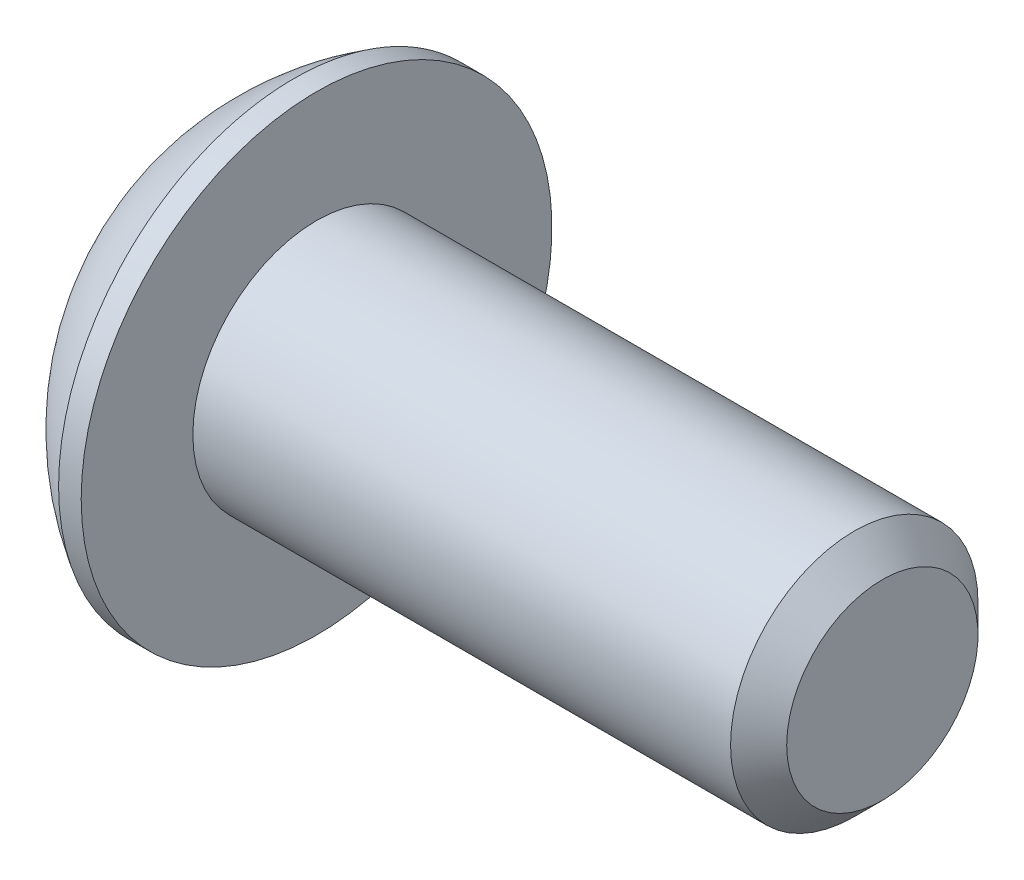
ISO-10303-21;
HEADER;
FILE_DESCRIPTION(('STEP AP214'),'2;1');
FILE_NAME('part.step','',(''),(''),'','','');
FILE_SCHEMA(('AUTOMOTIVE_DESIGN { 1 0 10303 214 1 1 1 1 }'));
ENDSEC;
DATA;
#1=APPLICATION_CONTEXT('core data for automotive mechanical design processes');
#2=APPLICATION_PROTOCOL_DEFINITION('international standard','automotive_design',2000,#1);
#3=PRODUCT_CONTEXT('',#1,'mechanical');
#4=PRODUCT('Part','Part','',(#3));
#5=PRODUCT_RELATED_PRODUCT_CATEGORY('part','',(#4));
#6=PRODUCT_DEFINITION_FORMATION('','',#4);
#7=PRODUCT_DEFINITION_CONTEXT('part definition',#1,'design');
#8=PRODUCT_DEFINITION('design','',#6,#7);
#9=PRODUCT_DEFINITION_SHAPE('','',#8);
#10=(LENGTH_UNIT() NAMED_UNIT(*) SI_UNIT(.MILLI.,.METRE.));
#11=(NAMED_UNIT(*) PLANE_ANGLE_UNIT() SI_UNIT($,.RADIAN.));
#12=(NAMED_UNIT(*) SI_UNIT($,.STERADIAN.) SOLID_ANGLE_UNIT());
#13=UNCERTAINTY_MEASURE_WITH_UNIT(LENGTH_MEASURE(1.E-05),#10,'distance_accuracy_value','');
#14=(GEOMETRIC_REPRESENTATION_CONTEXT(3) GLOBAL_UNCERTAINTY_ASSIGNED_CONTEXT((#13)) GLOBAL_UNIT_ASSIGNED_CONTEXT((#10,
#11,#12)) REPRESENTATION_CONTEXT('',''));
#15=CARTESIAN_POINT('',(0.,0.,0.));
#16=DIRECTION('',(0.,0.,1.));
#17=DIRECTION('',(1.,0.,0.));
#18=AXIS2_PLACEMENT_3D('',#15,#16,#17);
#19=CARTESIAN_POINT('',(1.32080000000034,0.,0.));
#20=DIRECTION('',(-1.,0.,0.));
#21=DIRECTION('',(0.,0.,1.));
#22=AXIS2_PLACEMENT_3D('',#19,#20,#21);
#23=CONICAL_SURFACE('',#22,1.1937999999998,1.04719755119608);
#24=CARTESIAN_POINT('',(2.01004075135902,0.,4.44089209850063E-13));
#25=VERTEX_POINT('',#24);
#26=VERTEX_LOOP('',#25);
#27=FACE_BOUND('',#26,.T.);
#28=CARTESIAN_POINT('',(1.32080000000009,0.,0.));
#29=DIRECTION('',(-1.,0.,0.));
#30=DIRECTION('',(0.,0.,1.));
#31=AXIS2_PLACEMENT_3D('',#28,#29,#30);
#32=CIRCLE('',#31,1.19380000000024);
#33=CARTESIAN_POINT('',(1.32080000000004,-1.03386112703797,0.59690000000006));
#34=VERTEX_POINT('',#33);
#35=CARTESIAN_POINT('',(1.32080000000004,0.,1.19380000000012));
#36=VERTEX_POINT('',#35);
#37=EDGE_CURVE('E20',#34,#36,#32,.T.);
#38=ORIENTED_EDGE('',*,*,#37,.T.);
#39=CARTESIAN_POINT('',(1.32080000000009,0.,0.));
#40=DIRECTION('',(-1.,0.,0.));
#41=DIRECTION('',(0.,0.,1.));
#42=AXIS2_PLACEMENT_3D('',#39,#40,#41);
#43=CIRCLE('',#42,1.19380000000024);
#44=CARTESIAN_POINT('',(1.32080000000004,1.03386112703797,0.596900000000061));
#45=VERTEX_POINT('',#44);
#46=EDGE_CURVE('E148',#36,#45,#43,.T.);
#47=ORIENTED_EDGE('',*,*,#46,.T.);
#48=CARTESIAN_POINT('',(1.32080000000009,0.,0.));
#49=DIRECTION('',(-1.,0.,0.));
#50=DIRECTION('',(0.,0.,1.));
#51=AXIS2_PLACEMENT_3D('',#48,#49,#50);
#52=CIRCLE('',#51,1.19380000000024);
#53=CARTESIAN_POINT('',(1.32080000000004,1.03386112703797,-0.596900000000061));
#54=VERTEX_POINT('',#53);
#55=EDGE_CURVE('E318',#45,#54,#52,.T.);
#56=ORIENTED_EDGE('',*,*,#55,.T.);
#57=CARTESIAN_POINT('',(1.32080000000009,0.,0.));
#58=DIRECTION('',(-1.,0.,0.));
#59=DIRECTION('',(0.,0.,1.));
#60=AXIS2_PLACEMENT_3D('',#57,#58,#59);
#61=CIRCLE('',#60,1.19380000000024);
#62=CARTESIAN_POINT('',(1.32080000000004,1.49457637585666E-12,-1.19380000000012));
#63=VERTEX_POINT('',#62);
#64=EDGE_CURVE('E319',#54,#63,#61,.T.);
#65=ORIENTED_EDGE('',*,*,#64,.T.);
#66=CARTESIAN_POINT('',(1.32080000000009,0.,0.));
#67=DIRECTION('',(-1.,0.,0.));
#68=DIRECTION('',(0.,0.,1.));
#69=AXIS2_PLACEMENT_3D('',#66,#67,#68);
#70=CIRCLE('',#69,1.19380000000024);
#71=CARTESIAN_POINT('',(1.32080000000004,-1.03386112703797,-0.59690000000006));
#72=VERTEX_POINT('',#71);
#73=EDGE_CURVE('E93',#63,#72,#70,.T.);
#74=ORIENTED_EDGE('',*,*,#73,.T.);
#75=CARTESIAN_POINT('',(1.32080000000009,0.,0.));
#76=DIRECTION('',(-1.,0.,0.));
#77=DIRECTION('',(0.,0.,1.));
#78=AXIS2_PLACEMENT_3D('',#75,#76,#77);
#79=CIRCLE('',#78,1.19380000000024);
#80=EDGE_CURVE('E89',#72,#34,#79,.T.);
#81=ORIENTED_EDGE('',*,*,#80,.T.);
#82=EDGE_LOOP('',(#38,#47,#56,#65,#74,#81));
#83=FACE_BOUND('',#82,.T.);
#84=ADVANCED_FACE('F17',(#27,#83),#23,.F.);
#85=CARTESIAN_POINT('',(1.3208,-2.06772225407572,-1.1938));
#86=DIRECTION('',(1.,0.,0.));
#87=DIRECTION('',(0.,0.,-1.));
#88=AXIS2_PLACEMENT_3D('',#85,#86,#87);
#89=PLANE('',#88);
#90=DIRECTION('',(0.,0.5,0.866025403784439));
#91=VECTOR('',#90,1.);
#92=CARTESIAN_POINT('',(1.3208,-1.37848150271715,0.));
#93=LINE('',#92,#91);
#94=CARTESIAN_POINT('',(1.3208,-0.689240751358574,1.1938));
#95=VERTEX_POINT('',#94);
#96=EDGE_CURVE('E101',#95,#34,#93,.F.);
#97=ORIENTED_EDGE('',*,*,#96,.F.);
#98=DIRECTION('',(0.,1.,0.));
#99=VECTOR('',#98,1.);
#100=CARTESIAN_POINT('',(1.3208,-0.689240751358574,1.1938));
#101=LINE('',#100,#99);
#102=EDGE_CURVE('E103',#36,#95,#101,.F.);
#103=ORIENTED_EDGE('',*,*,#102,.F.);
#104=ORIENTED_EDGE('',*,*,#37,.F.);
#105=EDGE_LOOP('',(#97,#103,#104));
#106=FACE_BOUND('',#105,.T.);
#107=ADVANCED_FACE('F99',(#106),#89,.F.);
#108=CARTESIAN_POINT('',(1.3208,-2.06772225407572,-1.1938));
#109=DIRECTION('',(1.,0.,0.));
#110=DIRECTION('',(0.,0.,-1.));
#111=AXIS2_PLACEMENT_3D('',#108,#109,#110);
#112=PLANE('',#111);
#113=DIRECTION('',(0.,-0.5,0.866025403784439));
#114=VECTOR('',#113,1.);
#115=CARTESIAN_POINT('',(1.3208,-0.689240751358574,-1.1938));
#116=LINE('',#115,#114);
#117=CARTESIAN_POINT('',(1.3208,-1.37848150271715,0.));
#118=VERTEX_POINT('',#117);
#119=EDGE_CURVE('E109',#118,#72,#116,.F.);
#120=ORIENTED_EDGE('',*,*,#119,.F.);
#121=DIRECTION('',(0.,0.5,0.866025403784439));
#122=VECTOR('',#121,1.);
#123=CARTESIAN_POINT('',(1.3208,-1.37848150271715,0.));
#124=LINE('',#123,#122);
#125=EDGE_CURVE('E106',#34,#118,#124,.F.);
#126=ORIENTED_EDGE('',*,*,#125,.F.);
#127=ORIENTED_EDGE('',*,*,#80,.F.);
#128=EDGE_LOOP('',(#120,#126,#127));
#129=FACE_BOUND('',#128,.T.);
#130=ADVANCED_FACE('F107',(#129),#112,.F.);
#131=CARTESIAN_POINT('',(1.3208,-2.06772225407572,-1.1938));
#132=DIRECTION('',(1.,0.,0.));
#133=DIRECTION('',(0.,0.,-1.));
#134=AXIS2_PLACEMENT_3D('',#131,#132,#133);
#135=PLANE('',#134);
#136=DIRECTION('',(0.,1.,0.));
#137=VECTOR('',#136,1.);
#138=CARTESIAN_POINT('',(1.3208,0.689240751358577,-1.1938));
#139=LINE('',#138,#137);
#140=CARTESIAN_POINT('',(1.3208,-0.689240751358574,-1.1938));
#141=VERTEX_POINT('',#140);
#142=EDGE_CURVE('E288',#141,#63,#139,.T.);
#143=ORIENTED_EDGE('',*,*,#142,.F.);
#144=DIRECTION('',(0.,-0.5,0.866025403784439));
#145=VECTOR('',#144,1.);
#146=CARTESIAN_POINT('',(1.3208,-0.689240751358574,-1.1938));
#147=LINE('',#146,#145);
#148=EDGE_CURVE('E300',#72,#141,#147,.F.);
#149=ORIENTED_EDGE('',*,*,#148,.F.);
#150=ORIENTED_EDGE('',*,*,#73,.F.);
#151=EDGE_LOOP('',(#143,#149,#150));
#152=FACE_BOUND('',#151,.T.);
#153=ADVANCED_FACE('F191',(#152),#135,.F.);
#154=CARTESIAN_POINT('',(1.3208,-2.06772225407572,-1.1938));
#155=DIRECTION('',(1.,0.,0.));
#156=DIRECTION('',(0.,0.,-1.));
#157=AXIS2_PLACEMENT_3D('',#154,#155,#156);
#158=PLANE('',#157);
#159=DIRECTION('',(0.,-0.5,-0.866025403784439));
#160=VECTOR('',#159,1.);
#161=CARTESIAN_POINT('',(1.3208,1.37848150271715,0.));
#162=LINE('',#161,#160);
#163=CARTESIAN_POINT('',(1.3208,0.689240751358577,-1.1938));
#164=VERTEX_POINT('',#163);
#165=EDGE_CURVE('E274',#164,#54,#162,.F.);
#166=ORIENTED_EDGE('',*,*,#165,.F.);
#167=DIRECTION('',(0.,1.,0.));
#168=VECTOR('',#167,1.);
#169=CARTESIAN_POINT('',(1.3208,0.689240751358577,-1.1938));
#170=LINE('',#169,#168);
#171=EDGE_CURVE('E285',#63,#164,#170,.T.);
#172=ORIENTED_EDGE('',*,*,#171,.F.);
#173=ORIENTED_EDGE('',*,*,#64,.F.);
#174=EDGE_LOOP('',(#166,#172,#173));
#175=FACE_BOUND('',#174,.T.);
#176=ADVANCED_FACE('F187',(#175),#158,.F.);
#177=CARTESIAN_POINT('',(1.3208,-2.06772225407572,-1.1938));
#178=DIRECTION('',(1.,0.,0.));
#179=DIRECTION('',(0.,0.,-1.));
#180=AXIS2_PLACEMENT_3D('',#177,#178,#179);
#181=PLANE('',#180);
#182=DIRECTION('',(0.,0.5,-0.866025403784439));
#183=VECTOR('',#182,1.);
#184=CARTESIAN_POINT('',(1.3208,0.689240751358576,1.1938));
#185=LINE('',#184,#183);
#186=CARTESIAN_POINT('',(1.3208,1.37848150271715,0.));
#187=VERTEX_POINT('',#186);
#188=EDGE_CURVE('E253',#187,#45,#185,.F.);
#189=ORIENTED_EDGE('',*,*,#188,.F.);
#190=DIRECTION('',(0.,-0.5,-0.866025403784439));
#191=VECTOR('',#190,1.);
#192=CARTESIAN_POINT('',(1.3208,1.37848150271715,0.));
#193=LINE('',#192,#191);
#194=EDGE_CURVE('E272',#54,#187,#193,.F.);
#195=ORIENTED_EDGE('',*,*,#194,.F.);
#196=ORIENTED_EDGE('',*,*,#55,.F.);
#197=EDGE_LOOP('',(#189,#195,#196));
#198=FACE_BOUND('',#197,.T.);
#199=ADVANCED_FACE('F183',(#198),#181,.F.);
#200=CARTESIAN_POINT('',(1.3208,-2.06772225407572,-1.1938));
#201=DIRECTION('',(1.,0.,0.));
#202=DIRECTION('',(0.,0.,-1.));
#203=AXIS2_PLACEMENT_3D('',#200,#201,#202);
#204=PLANE('',#203);
#205=DIRECTION('',(0.,1.,0.));
#206=VECTOR('',#205,1.);
#207=CARTESIAN_POINT('',(1.3208,-0.689240751358574,1.1938));
#208=LINE('',#207,#206);
#209=CARTESIAN_POINT('',(1.3208,0.689240751358576,1.1938));
#210=VERTEX_POINT('',#209);
#211=EDGE_CURVE('E118',#210,#36,#208,.F.);
#212=ORIENTED_EDGE('',*,*,#211,.F.);
#213=DIRECTION('',(0.,0.5,-0.866025403784439));
#214=VECTOR('',#213,1.);
#215=CARTESIAN_POINT('',(1.3208,0.689240751358576,1.1938));
#216=LINE('',#215,#214);
#217=EDGE_CURVE('E256',#45,#210,#216,.F.);
#218=ORIENTED_EDGE('',*,*,#217,.F.);
#219=ORIENTED_EDGE('',*,*,#46,.F.);
#220=EDGE_LOOP('',(#212,#218,#219));
#221=FACE_BOUND('',#220,.T.);
#222=ADVANCED_FACE('F179',(#221),#204,.F.);
#223=CARTESIAN_POINT('',(1.3208,-0.689240751358574,1.1938));
#224=DIRECTION('',(0.,0.,-1.));
#225=DIRECTION('',(0.,1.,0.));
#226=AXIS2_PLACEMENT_3D('',#223,#224,#225);
#227=PLANE('',#226);
#228=DIRECTION('',(0.,1.,0.));
#229=VECTOR('',#228,1.);
#230=CARTESIAN_POINT('',(0.,0.,1.1938));
#231=LINE('',#230,#229);
#232=CARTESIAN_POINT('',(0.,0.689240751358577,1.1938));
#233=VERTEX_POINT('',#232);
#234=CARTESIAN_POINT('',(0.,-0.689240751358574,1.1938));
#235=VERTEX_POINT('',#234);
#236=EDGE_CURVE('E250',#233,#235,#231,.F.);
#237=ORIENTED_EDGE('',*,*,#236,.F.);
#238=DIRECTION('',(1.,0.,0.));
#239=VECTOR('',#238,1.);
#240=CARTESIAN_POINT('',(1.3208,0.689240751358576,1.1938));
#241=LINE('',#240,#239);
#242=EDGE_CURVE('E262',#210,#233,#241,.F.);
#243=ORIENTED_EDGE('',*,*,#242,.F.);
#244=ORIENTED_EDGE('',*,*,#211,.T.);
#245=ORIENTED_EDGE('',*,*,#102,.T.);
#246=DIRECTION('',(1.,0.,0.));
#247=VECTOR('',#246,1.);
#248=CARTESIAN_POINT('',(1.3208,-0.689240751358574,1.1938));
#249=LINE('',#248,#247);
#250=EDGE_CURVE('E112',#235,#95,#249,.T.);
#251=ORIENTED_EDGE('',*,*,#250,.F.);
#252=EDGE_LOOP('',(#237,#243,#244,#245,#251));
#253=FACE_BOUND('',#252,.T.);
#254=ADVANCED_FACE('F176',(#253),#227,.T.);
#255=CARTESIAN_POINT('',(1.3208,-1.37848150271715,0.));
#256=DIRECTION('',(0.,0.866025403784439,-0.5));
#257=DIRECTION('',(0.,0.5,0.866025403784439));
#258=AXIS2_PLACEMENT_3D('',#255,#256,#257);
#259=PLANE('',#258);
#260=DIRECTION('',(0.,-0.5,-0.866025403784439));
#261=VECTOR('',#260,1.);
#262=CARTESIAN_POINT('',(0.,-0.689240751358574,1.1938));
#263=LINE('',#262,#261);
#264=CARTESIAN_POINT('',(0.,-1.37848150271715,0.));
#265=VERTEX_POINT('',#264);
#266=EDGE_CURVE('E247',#235,#265,#263,.T.);
#267=ORIENTED_EDGE('',*,*,#266,.F.);
#268=ORIENTED_EDGE('',*,*,#250,.T.);
#269=ORIENTED_EDGE('',*,*,#96,.T.);
#270=ORIENTED_EDGE('',*,*,#125,.T.);
#271=DIRECTION('',(1.,0.,0.));
#272=VECTOR('',#271,1.);
#273=CARTESIAN_POINT('',(1.3208,-1.37848150271715,0.));
#274=LINE('',#273,#272);
#275=EDGE_CURVE('E297',#265,#118,#274,.T.);
#276=ORIENTED_EDGE('',*,*,#275,.F.);
#277=EDGE_LOOP('',(#267,#268,#269,#270,#276));
#278=FACE_BOUND('',#277,.T.);
#279=ADVANCED_FACE('F116',(#278),#259,.T.);
#280=CARTESIAN_POINT('',(1.3208,-0.689240751358574,-1.1938));
#281=DIRECTION('',(0.,0.866025403784439,0.5));
#282=DIRECTION('',(0.,-0.5,0.866025403784439));
#283=AXIS2_PLACEMENT_3D('',#280,#281,#282);
#284=PLANE('',#283);
#285=DIRECTION('',(0.,0.5,-0.866025403784439));
#286=VECTOR('',#285,1.);
#287=CARTESIAN_POINT('',(0.,-1.37848150271715,0.));
#288=LINE('',#287,#286);
#289=CARTESIAN_POINT('',(0.,-0.689240751358574,-1.1938));
#290=VERTEX_POINT('',#289);
#291=EDGE_CURVE('E244',#265,#290,#288,.T.);
#292=ORIENTED_EDGE('',*,*,#291,.F.);
#293=ORIENTED_EDGE('',*,*,#275,.T.);
#294=ORIENTED_EDGE('',*,*,#119,.T.);
#295=ORIENTED_EDGE('',*,*,#148,.T.);
#296=DIRECTION('',(1.,0.,0.));
#297=VECTOR('',#296,1.);
#298=CARTESIAN_POINT('',(1.3208,-0.689240751358574,-1.1938));
#299=LINE('',#298,#297);
#300=EDGE_CURVE('E282',#290,#141,#299,.T.);
#301=ORIENTED_EDGE('',*,*,#300,.F.);
#302=EDGE_LOOP('',(#292,#293,#294,#295,#301));
#303=FACE_BOUND('',#302,.T.);
#304=ADVANCED_FACE('F169',(#303),#284,.T.);
#305=CARTESIAN_POINT('',(1.3208,0.689240751358577,-1.1938));
#306=DIRECTION('',(0.,0.,1.));
#307=DIRECTION('',(1.,0.,0.));
#308=AXIS2_PLACEMENT_3D('',#305,#306,#307);
#309=PLANE('',#308);
#310=DIRECTION('',(0.,1.,0.));
#311=VECTOR('',#310,1.);
#312=CARTESIAN_POINT('',(0.,0.,-1.1938));
#313=LINE('',#312,#311);
#314=CARTESIAN_POINT('',(0.,0.689240751358577,-1.1938));
#315=VERTEX_POINT('',#314);
#316=EDGE_CURVE('E241',#290,#315,#313,.T.);
#317=ORIENTED_EDGE('',*,*,#316,.F.);
#318=ORIENTED_EDGE('',*,*,#300,.T.);
#319=ORIENTED_EDGE('',*,*,#142,.T.);
#320=ORIENTED_EDGE('',*,*,#171,.T.);
#321=DIRECTION('',(1.,0.,0.));
#322=VECTOR('',#321,1.);
#323=CARTESIAN_POINT('',(1.3208,0.689240751358577,-1.1938));
#324=LINE('',#323,#322);
#325=EDGE_CURVE('E257',#315,#164,#324,.T.);
#326=ORIENTED_EDGE('',*,*,#325,.F.);
#327=EDGE_LOOP('',(#317,#318,#319,#320,#326));
#328=FACE_BOUND('',#327,.T.);
#329=ADVANCED_FACE('F166',(#328),#309,.T.);
#330=CARTESIAN_POINT('',(1.3208,1.37848150271715,0.));
#331=DIRECTION('',(0.,-0.866025403784439,0.5));
#332=DIRECTION('',(0.,-0.5,-0.866025403784439));
#333=AXIS2_PLACEMENT_3D('',#330,#331,#332);
#334=PLANE('',#333);
#335=DIRECTION('',(0.,0.5,0.866025403784439));
#336=VECTOR('',#335,1.);
#337=CARTESIAN_POINT('',(0.,0.689240751358577,-1.1938));
#338=LINE('',#337,#336);
#339=CARTESIAN_POINT('',(0.,1.37848150271715,0.));
#340=VERTEX_POINT('',#339);
#341=EDGE_CURVE('E238',#315,#340,#338,.T.);
#342=ORIENTED_EDGE('',*,*,#341,.F.);
#343=ORIENTED_EDGE('',*,*,#325,.T.);
#344=ORIENTED_EDGE('',*,*,#165,.T.);
#345=ORIENTED_EDGE('',*,*,#194,.T.);
#346=DIRECTION('',(1.,0.,0.));
#347=VECTOR('',#346,1.);
#348=CARTESIAN_POINT('',(1.3208,1.37848150271715,0.));
#349=LINE('',#348,#347);
#350=EDGE_CURVE('E35',#340,#187,#349,.T.);
#351=ORIENTED_EDGE('',*,*,#350,.F.);
#352=EDGE_LOOP('',(#342,#343,#344,#345,#351));
#353=FACE_BOUND('',#352,.T.);
#354=ADVANCED_FACE('F162',(#353),#334,.T.);
#355=CARTESIAN_POINT('',(1.3208,0.689240751358576,1.1938));
#356=DIRECTION('',(0.,-0.866025403784439,-0.5));
#357=DIRECTION('',(0.,0.5,-0.866025403784439));
#358=AXIS2_PLACEMENT_3D('',#355,#356,#357);
#359=PLANE('',#358);
#360=DIRECTION('',(0.,-0.5,0.866025403784439));
#361=VECTOR('',#360,1.);
#362=CARTESIAN_POINT('',(0.,1.37848150271715,0.));
#363=LINE('',#362,#361);
#364=EDGE_CURVE('E147',#340,#233,#363,.T.);
#365=ORIENTED_EDGE('',*,*,#364,.F.);
#366=ORIENTED_EDGE('',*,*,#350,.T.);
#367=ORIENTED_EDGE('',*,*,#188,.T.);
#368=ORIENTED_EDGE('',*,*,#217,.T.);
#369=ORIENTED_EDGE('',*,*,#242,.T.);
#370=EDGE_LOOP('',(#365,#366,#367,#368,#369));
#371=FACE_BOUND('',#370,.T.);
#372=ADVANCED_FACE('F158',(#371),#359,.T.);
#373=CARTESIAN_POINT('',(0.,0.,0.));
#374=DIRECTION('',(-1.,0.,0.));
#375=DIRECTION('',(0.,0.,1.));
#376=AXIS2_PLACEMENT_3D('',#373,#374,#375);
#377=PLANE('',#376);
#378=ORIENTED_EDGE('',*,*,#341,.T.);
#379=ORIENTED_EDGE('',*,*,#364,.T.);
#380=ORIENTED_EDGE('',*,*,#236,.T.);
#381=ORIENTED_EDGE('',*,*,#266,.T.);
#382=ORIENTED_EDGE('',*,*,#291,.T.);
#383=ORIENTED_EDGE('',*,*,#316,.T.);
#384=EDGE_LOOP('',(#378,#379,#380,#381,#382,#383));
#385=FACE_BOUND('',#384,.T.);
#386=CARTESIAN_POINT('',(0.,1.9812,0.));
#387=CARTESIAN_POINT('',(0.,1.9811996664299,0.0556258831179428));
#388=CARTESIAN_POINT('',(0.,1.97885520380442,0.111261989398606));
#389=CARTESIAN_POINT('',(0.,1.96949260169541,0.222149719830458));
#390=CARTESIAN_POINT('',(0.,1.96247308239605,0.277401225602895));
#391=CARTESIAN_POINT('',(0.,1.94379192841038,0.387209508139747));
#392=CARTESIAN_POINT('',(-1.85325793235264E-13,1.93212292489526,0.441765039546365));
#393=CARTESIAN_POINT('',(1.86344214223505E-13,1.90422331175315,0.549729449347493));
#394=CARTESIAN_POINT('',(6.94543371897454E-13,1.88798900035338,0.603137359208869));
#395=CARTESIAN_POINT('',(1.15501975216981E-12,1.83266214476501,0.760839131321828));
#396=CARTESIAN_POINT('',(0.,1.78690023648845,0.862876433575429));
#397=CARTESIAN_POINT('',(0.,1.67887358150667,1.05780719540872));
#398=CARTESIAN_POINT('',(9.54193214892627E-13,1.6166082074585,1.15070030720801));
#399=CARTESIAN_POINT('',(5.94805591894675E-13,1.51224157140982,1.28116890915697));
#400=CARTESIAN_POINT('',(1.63221293851378E-13,1.4755970394354,1.32320451127026));
#401=CARTESIAN_POINT('',(-1.62196980336157E-13,1.39893832619713,1.40400288695709));
#402=CARTESIAN_POINT('',(0.,1.35892742784698,1.44276877695455));
#403=CARTESIAN_POINT('',(1.14362537325405E-13,1.23416504602197,1.55382272417904));
#404=CARTESIAN_POINT('',(0.,1.14466125559859,1.62089527952111));
#405=CARTESIAN_POINT('',(0.,0.955712144178167,1.7390221808118));
#406=CARTESIAN_POINT('',(0.,0.856267198233564,1.79007713076007));
#407=CARTESIAN_POINT('',(0.,0.650206345910843,1.87477637530954));
#408=CARTESIAN_POINT('',(0.,0.543590516134855,1.90842085586267));
#409=CARTESIAN_POINT('',(0.,0.326226155292018,1.95733039300656));
#410=CARTESIAN_POINT('',(0.,0.21547760215793,1.97259535144288));
#411=CARTESIAN_POINT('',(0.,-0.00701040587544639,1.98431697865418));
#412=CARTESIAN_POINT('',(0.,-0.118749860774734,1.98077364742917));
#413=CARTESIAN_POINT('',(0.,-0.340050178355485,1.95497485623825));
#414=CARTESIAN_POINT('',(0.,-0.449611052668255,1.93271949620218));
#415=CARTESIAN_POINT('',(0.,-0.663431110729174,1.87014138774523));
#416=CARTESIAN_POINT('',(0.,-0.76769023783852,1.82981844635272));
#417=CARTESIAN_POINT('',(0.,-0.968005760719347,1.73219968377096));
#418=CARTESIAN_POINT('',(0.,-1.0640618469811,1.6749032225164));
#419=CARTESIAN_POINT('',(0.,-1.19980276751283,1.57757371205873));
#420=CARTESIAN_POINT('',(0.,-1.24366557129213,1.54322665019466));
#421=CARTESIAN_POINT('',(0.,-1.32838995706696,1.47093063174264));
#422=CARTESIAN_POINT('',(0.,-1.36924860178706,1.43297823102439));
#423=CARTESIAN_POINT('',(0.,-1.48674671849223,1.31419842051173));
#424=CARTESIAN_POINT('',(0.,-1.55842832343237,1.22836221289311));
#425=CARTESIAN_POINT('',(0.,-1.6863396856475,1.04586168272493));
#426=CARTESIAN_POINT('',(0.,-1.7425700302488,0.949197771949774));
#427=CARTESIAN_POINT('',(0.,-1.8141614250401,0.798182600298684));
#428=CARTESIAN_POINT('',(0.,-1.83591780585875,0.746776203847791));
#429=CARTESIAN_POINT('',(0.,-1.87500754181092,0.642341081688636));
#430=CARTESIAN_POINT('',(0.,-1.89234447645404,0.589313708122847));
#431=CARTESIAN_POINT('',(0.,-1.92246053433554,0.482076273028395));
#432=CARTESIAN_POINT('',(0.,-1.93524685475118,0.42786822425751));
#433=CARTESIAN_POINT('',(0.,-1.95620937250494,0.318578151844611));
#434=CARTESIAN_POINT('',(0.,-1.96438692958147,0.263496390912872));
#435=CARTESIAN_POINT('',(0.,-1.97388528284653,0.173607715038558));
#436=CARTESIAN_POINT('',(0.,-1.97662743364426,0.138944718024998));
#437=CARTESIAN_POINT('',(0.,-1.98028489645283,0.0695224782567002));
#438=CARTESIAN_POINT('',(0.,-1.98120020846367,0.0347632355019631));
#439=CARTESIAN_POINT('',(0.,-1.9811996664299,-0.0556258831179437));
#440=CARTESIAN_POINT('',(0.,-1.97885520380442,-0.111261989398607));
#441=CARTESIAN_POINT('',(0.,-1.96949260169541,-0.222149719830459));
#442=CARTESIAN_POINT('',(0.,-1.96247308239605,-0.277401225602897));
#443=CARTESIAN_POINT('',(0.,-1.94379192841039,-0.387209508139749));
#444=CARTESIAN_POINT('',(-1.85269749640691E-13,-1.93212292489526,-0.441765039546367));
#445=CARTESIAN_POINT('',(1.86288125054388E-13,-1.90422331175315,-0.549729449347495));
#446=CARTESIAN_POINT('',(6.94525090263764E-13,-1.88798900035338,-0.603137359208872));
#447=CARTESIAN_POINT('',(1.15505622829081E-12,-1.83266214476501,-0.760839131321831));
#448=CARTESIAN_POINT('',(0.,-1.78690023648845,-0.862876433575431));
#449=CARTESIAN_POINT('',(0.,-1.67887358150667,-1.05780719540872));
#450=CARTESIAN_POINT('',(9.54248812869379E-13,-1.6166082074585,-1.15070030720801));
#451=CARTESIAN_POINT('',(5.94777756479239E-13,-1.51224157140982,-1.28116890915698));
#452=CARTESIAN_POINT('',(1.63138949183833E-13,-1.47559703943539,-1.32320451127027));
#453=CARTESIAN_POINT('',(-1.62114715061273E-13,-1.39893832619713,-1.40400288695709));
#454=CARTESIAN_POINT('',(0.,-1.35892742784699,-1.44276877695455));
#455=CARTESIAN_POINT('',(1.13760489124207E-13,-1.23416504602197,-1.55382272417904));
#456=CARTESIAN_POINT('',(0.,-1.14466125559859,-1.62089527952111));
#457=CARTESIAN_POINT('',(0.,-0.95571214417816,-1.73902218081179));
#458=CARTESIAN_POINT('',(0.,-0.856267198233559,-1.79007713076007));
#459=CARTESIAN_POINT('',(0.,-0.650206345910841,-1.87477637530954));
#460=CARTESIAN_POINT('',(0.,-0.543590516134854,-1.90842085586267));
#461=CARTESIAN_POINT('',(0.,-0.326226155292018,-1.95733039300657));
#462=CARTESIAN_POINT('',(0.,-0.215477602157929,-1.97259535144288));
#463=CARTESIAN_POINT('',(0.,0.0070104058754487,-1.98431697865418));
#464=CARTESIAN_POINT('',(0.,0.118749860774737,-1.98077364742916));
#465=CARTESIAN_POINT('',(0.,0.340050178355489,-1.95497485623824));
#466=CARTESIAN_POINT('',(0.,0.44961105266826,-1.93271949620218));
#467=CARTESIAN_POINT('',(0.,0.663431110729178,-1.87014138774524));
#468=CARTESIAN_POINT('',(0.,0.767690237838524,-1.82981844635272));
#469=CARTESIAN_POINT('',(0.,0.968005760719348,-1.73219968377096));
#470=CARTESIAN_POINT('',(0.,1.0640618469811,-1.67490322251639));
#471=CARTESIAN_POINT('',(0.,1.19980276751283,-1.57757371205873));
#472=CARTESIAN_POINT('',(0.,1.24366557129214,-1.54322665019465));
#473=CARTESIAN_POINT('',(0.,1.32838995706696,-1.47093063174263));
#474=CARTESIAN_POINT('',(0.,1.36924860178706,-1.43297823102439));
#475=CARTESIAN_POINT('',(0.,1.48674671849223,-1.31419842051172));
#476=CARTESIAN_POINT('',(0.,1.55842832343237,-1.22836221289311));
#477=CARTESIAN_POINT('',(0.,1.6863396856475,-1.04586168272492));
#478=CARTESIAN_POINT('',(0.,1.7425700302488,-0.949197771949768));
#479=CARTESIAN_POINT('',(0.,1.8141614250401,-0.798182600298677));
#480=CARTESIAN_POINT('',(0.,1.83591780585875,-0.746776203847785));
#481=CARTESIAN_POINT('',(0.,1.87500754181092,-0.64234108168863));
#482=CARTESIAN_POINT('',(0.,1.89234447645404,-0.589313708122841));
#483=CARTESIAN_POINT('',(0.,1.92246053433555,-0.482076273028389));
#484=CARTESIAN_POINT('',(0.,1.93524685475118,-0.427868224257505));
#485=CARTESIAN_POINT('',(0.,1.95620937250494,-0.318578151844605));
#486=CARTESIAN_POINT('',(0.,1.96438692958147,-0.263496390912866));
#487=CARTESIAN_POINT('',(0.,1.97388528284653,-0.173607715038553));
#488=CARTESIAN_POINT('',(0.,1.97662743364426,-0.138944718024994));
#489=CARTESIAN_POINT('',(0.,1.98028489645283,-0.0695224782566989));
#490=CARTESIAN_POINT('',(0.,1.98120020846367,-0.034763235501963));
#491=CARTESIAN_POINT('',(0.,1.9812,0.));
#492=B_SPLINE_CURVE_WITH_KNOTS('',3,(#386,#387,#388,#389,#390,#391,#392,#393,#394,#395,#396,
#397,#398,#399,#400,#401,#402,#403,#404,#405,#406,#407,#408,#409,#410,#411,#412,#413,#414,#415,
#416,#417,#418,#419,#420,#421,#422,#423,#424,#425,#426,#427,#428,#429,#430,#431,#432,#433,#434,
#435,#436,#437,#438,#439,#440,#441,#442,#443,#444,#445,#446,#447,#448,#449,#450,#451,#452,#453,
#454,#455,#456,#457,#458,#459,#460,#461,#462,#463,#464,#465,#466,#467,#468,#469,#470,#471,#472,
#473,#474,#475,#476,#477,#478,#479,#480,#481,#482,#483,#484,#485,#486,#487,#488,#489,#490,#491),
.UNSPECIFIED.,.T.,.F.,(4,2,2,2,2,2,2,2,2,2,2,2,2,2,2,2,2,2,2,2,2,2,2,2,2,2,2,2,2,2,2,2,2,2,2,2,
2,2,2,2,2,2,2,2,2,2,2,2,2,2,2,2,4),(0.,0.166845646007828,0.333740557374255,0.500901034367693,
0.668197445942386,1.00199278686282,1.33580081809885,1.50292354032982,1.6698851310853,
2.00370118900129,2.33750465770544,2.67130456115909,3.005106247238,3.33890793331696,
3.67270783677065,4.00651130547476,4.34032736339026,4.50728895414554,4.67441167637632,
5.00821970761259,5.34201504853332,5.50931146010827,5.67647193710191,5.84336684846844,
6.0102124944764,6.11448220058334,6.21875190669029,6.38559755269812,6.55249246406454,
6.71965294105798,6.88694935263268,7.22074469355311,7.55455272478915,7.72167544702011,
7.88863703777559,8.22245309569158,8.55625656439573,8.89005646784938,9.2238581539283,
9.55765984000725,9.89145974346094,10.2252632121651,10.5590792700806,10.7260408608358,
10.8931635830666,11.2269716143029,11.5607669552236,11.7280633667986,11.8952238437922,
12.0621187551587,12.2289644011667,12.3332341072736,12.4375038133806),.UNSPECIFIED.);
#493=CARTESIAN_POINT('',(0.,1.9812,0.));
#494=VERTEX_POINT('',#493);
#495=EDGE_CURVE('E140',#494,#494,#492,.T.);
#496=ORIENTED_EDGE('',*,*,#495,.F.);
#497=EDGE_LOOP('',(#496));
#498=FACE_BOUND('',#497,.T.);
#499=ADVANCED_FACE('F154',(#385,#498),#377,.T.);
#500=CARTESIAN_POINT('',(4.13385,0.,0.));
#501=DIRECTION('',(0.,1.,0.));
#502=DIRECTION('',(1.,0.,0.));
#503=AXIS2_PLACEMENT_3D('',#500,#501,#502);
#504=SPHERICAL_SURFACE('',#503,4.58408870578439);
#505=CARTESIAN_POINT('',(1.8288,0.,0.));
#506=DIRECTION('',(-1.,0.,0.));
#507=DIRECTION('',(0.,0.,1.));
#508=AXIS2_PLACEMENT_3D('',#505,#506,#507);
#509=CIRCLE('',#508,3.9624);
#510=CARTESIAN_POINT('',(1.8288,0.,3.9624));
#511=VERTEX_POINT('',#510);
#512=EDGE_CURVE('E137',#511,#511,#509,.F.);
#513=ORIENTED_EDGE('',*,*,#512,.F.);
#514=EDGE_LOOP('',(#513));
#515=FACE_BOUND('',#514,.T.);
#516=ORIENTED_EDGE('',*,*,#495,.T.);
#517=EDGE_LOOP('',(#516));
#518=FACE_BOUND('',#517,.T.);
#519=ADVANCED_FACE('F150',(#515,#518),#504,.T.);
#520=CARTESIAN_POINT('',(11.7348,0.,0.));
#521=DIRECTION('',(-1.,0.,0.));
#522=DIRECTION('',(0.,0.,1.));
#523=AXIS2_PLACEMENT_3D('',#520,#521,#522);
#524=PLANE('',#523);
#525=CARTESIAN_POINT('',(11.7347999999424,0.,0.));
#526=DIRECTION('',(-1.,0.,0.));
#527=DIRECTION('',(0.,0.,1.));
#528=AXIS2_PLACEMENT_3D('',#525,#526,#527);
#529=CIRCLE('',#528,1.61036000002923);
#530=CARTESIAN_POINT('',(11.7347999999424,0.,1.61036000002923));
#531=VERTEX_POINT('',#530);
#532=EDGE_CURVE('E134',#531,#531,#529,.T.);
#533=ORIENTED_EDGE('',*,*,#532,.F.);
#534=EDGE_LOOP('',(#533));
#535=FACE_BOUND('',#534,.T.);
#536=ADVANCED_FACE('F222',(#535),#524,.F.);
#537=CARTESIAN_POINT('',(0.,0.,0.));
#538=DIRECTION('',(-1.,0.,0.));
#539=DIRECTION('',(0.,0.,1.));
#540=AXIS2_PLACEMENT_3D('',#537,#538,#539);
#541=CYLINDRICAL_SURFACE('',#540,3.9624);
#542=ORIENTED_EDGE('',*,*,#512,.T.);
#543=EDGE_LOOP('',(#542));
#544=FACE_BOUND('',#543,.T.);
#545=CARTESIAN_POINT('',(2.2098,0.,0.));
#546=DIRECTION('',(-1.,0.,0.));
#547=DIRECTION('',(0.,0.,1.));
#548=AXIS2_PLACEMENT_3D('',#545,#546,#547);
#549=CIRCLE('',#548,3.9624);
#550=CARTESIAN_POINT('',(2.2098,0.,3.9624));
#551=VERTEX_POINT('',#550);
#552=EDGE_CURVE('E131',#551,#551,#549,.T.);
#553=ORIENTED_EDGE('',*,*,#552,.T.);
#554=EDGE_LOOP('',(#553));
#555=FACE_BOUND('',#554,.T.);
#556=ADVANCED_FACE('F219',(#544,#555),#541,.T.);
#557=CARTESIAN_POINT('',(11.2623600000461,0.,0.));
#558=DIRECTION('',(-1.,0.,0.));
#559=DIRECTION('',(0.,0.,1.));
#560=AXIS2_PLACEMENT_3D('',#557,#558,#559);
#561=CONICAL_SURFACE('',#560,2.08279999992556,0.785398163397448);
#562=ORIENTED_EDGE('',*,*,#532,.T.);
#563=EDGE_LOOP('',(#562));
#564=FACE_BOUND('',#563,.T.);
#565=CARTESIAN_POINT('',(11.26236,0.,0.));
#566=DIRECTION('',(-1.,0.,0.));
#567=DIRECTION('',(0.,0.,1.));
#568=AXIS2_PLACEMENT_3D('',#565,#566,#567);
#569=CIRCLE('',#568,2.0828);
#570=CARTESIAN_POINT('',(11.26236,0.,2.0828));
#571=VERTEX_POINT('',#570);
#572=EDGE_CURVE('E26',#571,#571,#569,.T.);
#573=ORIENTED_EDGE('',*,*,#572,.F.);
#574=EDGE_LOOP('',(#573));
#575=FACE_BOUND('',#574,.T.);
#576=ADVANCED_FACE('F211',(#564,#575),#561,.T.);
#577=CARTESIAN_POINT('',(2.2098,2.0828,0.));
#578=DIRECTION('',(-1.,0.,0.));
#579=DIRECTION('',(0.,0.,1.));
#580=AXIS2_PLACEMENT_3D('',#577,#578,#579);
#581=PLANE('',#580);
#582=CARTESIAN_POINT('',(2.2098,0.,0.));
#583=DIRECTION('',(-1.,0.,0.));
#584=DIRECTION('',(0.,0.,1.));
#585=AXIS2_PLACEMENT_3D('',#582,#583,#584);
#586=CIRCLE('',#585,2.0828);
#587=CARTESIAN_POINT('',(2.2098,0.,2.0828));
#588=VERTEX_POINT('',#587);
#589=EDGE_CURVE('E10',#588,#588,#586,.F.);
#590=ORIENTED_EDGE('',*,*,#589,.F.);
#591=EDGE_LOOP('',(#590));
#592=FACE_BOUND('',#591,.T.);
#593=ORIENTED_EDGE('',*,*,#552,.F.);
#594=EDGE_LOOP('',(#593));
#595=FACE_BOUND('',#594,.T.);
#596=ADVANCED_FACE('F205',(#592,#595),#581,.F.);
#597=CARTESIAN_POINT('',(0.,0.,0.));
#598=DIRECTION('',(-1.,0.,0.));
#599=DIRECTION('',(0.,0.,1.));
#600=AXIS2_PLACEMENT_3D('',#597,#598,#599);
#601=CYLINDRICAL_SURFACE('',#600,2.0828);
#602=ORIENTED_EDGE('',*,*,#572,.T.);
#603=EDGE_LOOP('',(#602));
#604=FACE_BOUND('',#603,.T.);
#605=ORIENTED_EDGE('',*,*,#589,.T.);
#606=EDGE_LOOP('',(#605));
#607=FACE_BOUND('',#606,.T.);
#608=ADVANCED_FACE('F203',(#604,#607),#601,.T.);
#609=CLOSED_SHELL('',(#84,#107,#130,#153,#176,#199,#222,#254,#279,#304,#329,#354,#372,#499,#519,
#536,#556,#576,#596,#608));
#610=MANIFOLD_SOLID_BREP('B1',#609);
#611=ADVANCED_BREP_SHAPE_REPRESENTATION('',(#18,#610),#14);
#612=SHAPE_DEFINITION_REPRESENTATION(#9,#611);
ENDSEC;
END-ISO-10303-21;
